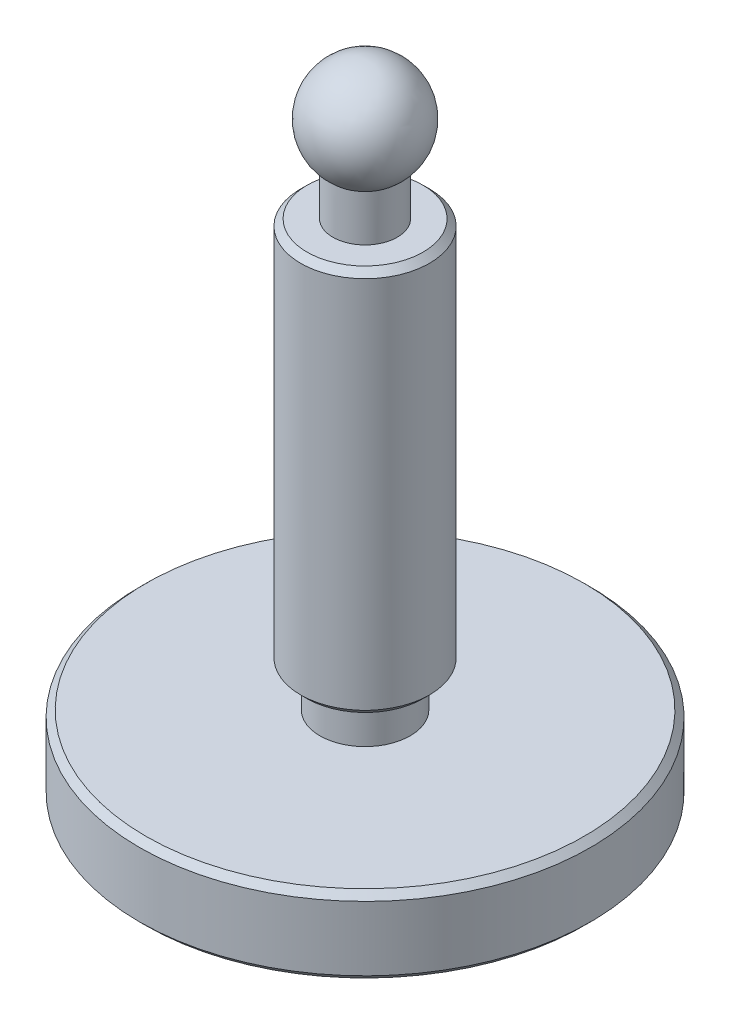
ISO-10303-21;
HEADER;
FILE_DESCRIPTION(('STEP AP214'),'2;1');
FILE_NAME('part.step','',(''),(''),'','','');
FILE_SCHEMA(('AUTOMOTIVE_DESIGN { 1 0 10303 214 1 1 1 1 }'));
ENDSEC;
DATA;
#1=APPLICATION_CONTEXT('core data for automotive mechanical design processes');
#2=APPLICATION_PROTOCOL_DEFINITION('international standard','automotive_design',2000,#1);
#3=PRODUCT_CONTEXT('',#1,'mechanical');
#4=PRODUCT('Part','Part','',(#3));
#5=PRODUCT_RELATED_PRODUCT_CATEGORY('part','',(#4));
#6=PRODUCT_DEFINITION_FORMATION('','',#4);
#7=PRODUCT_DEFINITION_CONTEXT('part definition',#1,'design');
#8=PRODUCT_DEFINITION('design','',#6,#7);
#9=PRODUCT_DEFINITION_SHAPE('','',#8);
#10=(LENGTH_UNIT() NAMED_UNIT(*) SI_UNIT(.MILLI.,.METRE.));
#11=(NAMED_UNIT(*) PLANE_ANGLE_UNIT() SI_UNIT($,.RADIAN.));
#12=(NAMED_UNIT(*) SI_UNIT($,.STERADIAN.) SOLID_ANGLE_UNIT());
#13=UNCERTAINTY_MEASURE_WITH_UNIT(LENGTH_MEASURE(1.E-05),#10,'distance_accuracy_value','');
#14=(GEOMETRIC_REPRESENTATION_CONTEXT(3) GLOBAL_UNCERTAINTY_ASSIGNED_CONTEXT((#13)) GLOBAL_UNIT_ASSIGNED_CONTEXT((#10,
#11,#12)) REPRESENTATION_CONTEXT('',''));
#15=CARTESIAN_POINT('',(0.,0.,0.));
#16=DIRECTION('',(0.,0.,1.));
#17=DIRECTION('',(1.,0.,0.));
#18=AXIS2_PLACEMENT_3D('',#15,#16,#17);
#19=CARTESIAN_POINT('',(0.,6.,0.));
#20=DIRECTION('',(0.,-1.,0.));
#21=DIRECTION('',(0.,0.,-1.));
#22=AXIS2_PLACEMENT_3D('',#19,#20,#21);
#23=CYLINDRICAL_SURFACE('',#22,17.5);
#24=CARTESIAN_POINT('',(0.,0.500000000000004,0.));
#25=DIRECTION('',(0.,1.,0.));
#26=DIRECTION('',(0.,0.,1.));
#27=AXIS2_PLACEMENT_3D('',#24,#25,#26);
#28=CIRCLE('',#27,17.5);
#29=CARTESIAN_POINT('',(0.,0.500000000000004,17.5));
#30=VERTEX_POINT('',#29);
#31=EDGE_CURVE('E76',#30,#30,#28,.T.);
#32=ORIENTED_EDGE('',*,*,#31,.T.);
#33=EDGE_LOOP('',(#32));
#34=FACE_BOUND('',#33,.T.);
#35=CARTESIAN_POINT('',(0.,5.50000000000002,0.));
#36=DIRECTION('',(0.,1.,0.));
#37=DIRECTION('',(0.,0.,1.));
#38=AXIS2_PLACEMENT_3D('',#35,#36,#37);
#39=CIRCLE('',#38,17.5);
#40=CARTESIAN_POINT('',(0.,5.50000000000002,17.5));
#41=VERTEX_POINT('',#40);
#42=EDGE_CURVE('E68',#41,#41,#39,.F.);
#43=ORIENTED_EDGE('',*,*,#42,.T.);
#44=EDGE_LOOP('',(#43));
#45=FACE_BOUND('',#44,.T.);
#46=ADVANCED_FACE('F37',(#34,#45),#23,.T.);
#47=CARTESIAN_POINT('',(0.,6.,0.));
#48=DIRECTION('',(0.,1.,0.));
#49=DIRECTION('',(0.,0.,1.));
#50=AXIS2_PLACEMENT_3D('',#47,#48,#49);
#51=PLANE('',#50);
#52=CARTESIAN_POINT('',(0.,6.,0.));
#53=DIRECTION('',(0.,1.,0.));
#54=DIRECTION('',(0.,0.,1.));
#55=AXIS2_PLACEMENT_3D('',#52,#53,#54);
#56=CIRCLE('',#55,3.5);
#57=CARTESIAN_POINT('',(0.,6.,3.5));
#58=VERTEX_POINT('',#57);
#59=EDGE_CURVE('E62',#58,#58,#56,.F.);
#60=ORIENTED_EDGE('',*,*,#59,.T.);
#61=EDGE_LOOP('',(#60));
#62=FACE_BOUND('',#61,.T.);
#63=CARTESIAN_POINT('',(0.,6.,0.));
#64=DIRECTION('',(0.,1.,0.));
#65=DIRECTION('',(0.,0.,1.));
#66=AXIS2_PLACEMENT_3D('',#63,#64,#65);
#67=CIRCLE('',#66,17.);
#68=CARTESIAN_POINT('',(0.,6.,17.));
#69=VERTEX_POINT('',#68);
#70=EDGE_CURVE('E57',#69,#69,#67,.T.);
#71=ORIENTED_EDGE('',*,*,#70,.T.);
#72=EDGE_LOOP('',(#71));
#73=FACE_BOUND('',#72,.T.);
#74=ADVANCED_FACE('F91',(#62,#73),#51,.T.);
#75=CARTESIAN_POINT('',(0.,0.,0.));
#76=DIRECTION('',(0.,1.,0.));
#77=DIRECTION('',(0.,0.,1.));
#78=AXIS2_PLACEMENT_3D('',#75,#76,#77);
#79=PLANE('',#78);
#80=CARTESIAN_POINT('',(0.,0.,0.));
#81=DIRECTION('',(0.,1.,0.));
#82=DIRECTION('',(0.,0.,1.));
#83=AXIS2_PLACEMENT_3D('',#80,#81,#82);
#84=CIRCLE('',#83,17.);
#85=CARTESIAN_POINT('',(0.,0.,17.));
#86=VERTEX_POINT('',#85);
#87=EDGE_CURVE('E73',#86,#86,#84,.F.);
#88=ORIENTED_EDGE('',*,*,#87,.T.);
#89=EDGE_LOOP('',(#88));
#90=FACE_BOUND('',#89,.T.);
#91=ADVANCED_FACE('F93',(#90),#79,.F.);
#92=CARTESIAN_POINT('',(0.,0.500000000000004,0.));
#93=DIRECTION('',(0.,1.,0.));
#94=DIRECTION('',(0.,0.,1.));
#95=AXIS2_PLACEMENT_3D('',#92,#93,#94);
#96=CONICAL_SURFACE('',#95,17.5,0.785398163397445);
#97=ORIENTED_EDGE('',*,*,#87,.F.);
#98=EDGE_LOOP('',(#97));
#99=FACE_BOUND('',#98,.T.);
#100=ORIENTED_EDGE('',*,*,#31,.F.);
#101=EDGE_LOOP('',(#100));
#102=FACE_BOUND('',#101,.T.);
#103=ADVANCED_FACE('F87',(#99,#102),#96,.T.);
#104=CARTESIAN_POINT('',(0.,6.,0.));
#105=DIRECTION('',(0.,-1.,0.));
#106=DIRECTION('',(0.,0.,-1.));
#107=AXIS2_PLACEMENT_3D('',#104,#105,#106);
#108=CONICAL_SURFACE('',#107,17.,0.785398163397441);
#109=ORIENTED_EDGE('',*,*,#42,.F.);
#110=EDGE_LOOP('',(#109));
#111=FACE_BOUND('',#110,.T.);
#112=ORIENTED_EDGE('',*,*,#70,.F.);
#113=EDGE_LOOP('',(#112));
#114=FACE_BOUND('',#113,.T.);
#115=ADVANCED_FACE('F83',(#111,#114),#108,.T.);
#116=CARTESIAN_POINT('',(0.,45.7080992435478,0.));
#117=DIRECTION('',(0.,-1.,0.));
#118=DIRECTION('',(1.,0.,0.));
#119=AXIS2_PLACEMENT_3D('',#116,#117,#118);
#120=SPHERICAL_SURFACE('',#119,4.);
#121=CARTESIAN_POINT('',(0.,42.5856002443486,0.));
#122=DIRECTION('',(0.,1.,0.));
#123=DIRECTION('',(0.,0.,1.));
#124=AXIS2_PLACEMENT_3D('',#121,#122,#123);
#125=CIRCLE('',#124,2.5);
#126=CARTESIAN_POINT('',(0.,42.5856002443486,2.5));
#127=VERTEX_POINT('',#126);
#128=EDGE_CURVE('E65',#127,#127,#125,.F.);
#129=ORIENTED_EDGE('',*,*,#128,.F.);
#130=EDGE_LOOP('',(#129));
#131=FACE_BOUND('',#130,.T.);
#132=ADVANCED_FACE('F86',(#131),#120,.T.);
#133=CARTESIAN_POINT('',(0.,0.,0.));
#134=DIRECTION('',(0.,-1.,0.));
#135=DIRECTION('',(0.,0.,-1.));
#136=AXIS2_PLACEMENT_3D('',#133,#134,#135);
#137=CYLINDRICAL_SURFACE('',#136,2.5);
#138=CARTESIAN_POINT('',(0.,39.,0.));
#139=DIRECTION('',(0.,-1.,0.));
#140=DIRECTION('',(0.,0.,-1.));
#141=AXIS2_PLACEMENT_3D('',#138,#139,#140);
#142=CIRCLE('',#141,2.5);
#143=CARTESIAN_POINT('',(0.,39.,-2.5));
#144=VERTEX_POINT('',#143);
#145=EDGE_CURVE('E61',#144,#144,#142,.T.);
#146=ORIENTED_EDGE('',*,*,#145,.F.);
#147=EDGE_LOOP('',(#146));
#148=FACE_BOUND('',#147,.T.);
#149=ORIENTED_EDGE('',*,*,#128,.T.);
#150=EDGE_LOOP('',(#149));
#151=FACE_BOUND('',#150,.T.);
#152=ADVANCED_FACE('F110',(#148,#151),#137,.T.);
#153=CARTESIAN_POINT('',(-5.,39.,0.));
#154=DIRECTION('',(0.,-1.,0.));
#155=DIRECTION('',(0.,0.,-1.));
#156=AXIS2_PLACEMENT_3D('',#153,#154,#155);
#157=PLANE('',#156);
#158=CARTESIAN_POINT('',(0.,39.,0.));
#159=DIRECTION('',(0.,-1.,0.));
#160=DIRECTION('',(0.,0.,-1.));
#161=AXIS2_PLACEMENT_3D('',#158,#159,#160);
#162=CIRCLE('',#161,4.5);
#163=CARTESIAN_POINT('',(0.,39.,-4.5));
#164=VERTEX_POINT('',#163);
#165=EDGE_CURVE('E11',#164,#164,#162,.F.);
#166=ORIENTED_EDGE('',*,*,#165,.T.);
#167=EDGE_LOOP('',(#166));
#168=FACE_BOUND('',#167,.T.);
#169=ORIENTED_EDGE('',*,*,#145,.T.);
#170=EDGE_LOOP('',(#169));
#171=FACE_BOUND('',#170,.T.);
#172=ADVANCED_FACE('F113',(#168,#171),#157,.F.);
#173=CARTESIAN_POINT('',(0.,0.,0.));
#174=DIRECTION('',(0.,-1.,0.));
#175=DIRECTION('',(0.,0.,-1.));
#176=AXIS2_PLACEMENT_3D('',#173,#174,#175);
#177=CYLINDRICAL_SURFACE('',#176,5.);
#178=CARTESIAN_POINT('',(0.,9.49999999999999,0.));
#179=DIRECTION('',(0.,1.,0.));
#180=DIRECTION('',(0.,0.,1.));
#181=AXIS2_PLACEMENT_3D('',#178,#179,#180);
#182=CIRCLE('',#181,5.);
#183=CARTESIAN_POINT('',(0.,9.49999999999999,5.));
#184=VERTEX_POINT('',#183);
#185=EDGE_CURVE('E44',#184,#184,#182,.T.);
#186=ORIENTED_EDGE('',*,*,#185,.T.);
#187=EDGE_LOOP('',(#186));
#188=FACE_BOUND('',#187,.T.);
#189=CARTESIAN_POINT('',(0.,38.5,0.));
#190=DIRECTION('',(0.,-1.,0.));
#191=DIRECTION('',(0.,0.,-1.));
#192=AXIS2_PLACEMENT_3D('',#189,#190,#191);
#193=CIRCLE('',#192,5.);
#194=CARTESIAN_POINT('',(0.,38.5,-5.));
#195=VERTEX_POINT('',#194);
#196=EDGE_CURVE('E48',#195,#195,#193,.T.);
#197=ORIENTED_EDGE('',*,*,#196,.T.);
#198=EDGE_LOOP('',(#197));
#199=FACE_BOUND('',#198,.T.);
#200=ADVANCED_FACE('F131',(#188,#199),#177,.T.);
#201=CARTESIAN_POINT('',(-2.5,9.,0.));
#202=DIRECTION('',(0.,1.,0.));
#203=DIRECTION('',(0.,0.,1.));
#204=AXIS2_PLACEMENT_3D('',#201,#202,#203);
#205=PLANE('',#204);
#206=CARTESIAN_POINT('',(0.,9.,0.));
#207=DIRECTION('',(0.,1.,0.));
#208=DIRECTION('',(0.,0.,1.));
#209=AXIS2_PLACEMENT_3D('',#206,#207,#208);
#210=CIRCLE('',#209,4.50000000000002);
#211=CARTESIAN_POINT('',(0.,9.,4.50000000000002));
#212=VERTEX_POINT('',#211);
#213=EDGE_CURVE('E52',#212,#212,#210,.F.);
#214=ORIENTED_EDGE('',*,*,#213,.T.);
#215=EDGE_LOOP('',(#214));
#216=FACE_BOUND('',#215,.T.);
#217=CARTESIAN_POINT('',(0.,9.,0.));
#218=DIRECTION('',(0.,1.,0.));
#219=DIRECTION('',(0.,0.,1.));
#220=AXIS2_PLACEMENT_3D('',#217,#218,#219);
#221=CIRCLE('',#220,3.5);
#222=CARTESIAN_POINT('',(0.,9.,3.5));
#223=VERTEX_POINT('',#222);
#224=EDGE_CURVE('E58',#223,#223,#221,.F.);
#225=ORIENTED_EDGE('',*,*,#224,.F.);
#226=EDGE_LOOP('',(#225));
#227=FACE_BOUND('',#226,.T.);
#228=ADVANCED_FACE('F118',(#216,#227),#205,.F.);
#229=CARTESIAN_POINT('',(0.,0.,0.));
#230=DIRECTION('',(0.,-1.,0.));
#231=DIRECTION('',(0.,0.,-1.));
#232=AXIS2_PLACEMENT_3D('',#229,#230,#231);
#233=CYLINDRICAL_SURFACE('',#232,3.5);
#234=ORIENTED_EDGE('',*,*,#59,.F.);
#235=EDGE_LOOP('',(#234));
#236=FACE_BOUND('',#235,.T.);
#237=ORIENTED_EDGE('',*,*,#224,.T.);
#238=EDGE_LOOP('',(#237));
#239=FACE_BOUND('',#238,.T.);
#240=ADVANCED_FACE('F115',(#236,#239),#233,.T.);
#241=CARTESIAN_POINT('',(0.,9.,0.));
#242=DIRECTION('',(0.,1.,0.));
#243=DIRECTION('',(0.,0.,1.));
#244=AXIS2_PLACEMENT_3D('',#241,#242,#243);
#245=CONICAL_SURFACE('',#244,4.50000000000002,0.785398163397445);
#246=ORIENTED_EDGE('',*,*,#185,.F.);
#247=EDGE_LOOP('',(#246));
#248=FACE_BOUND('',#247,.T.);
#249=ORIENTED_EDGE('',*,*,#213,.F.);
#250=EDGE_LOOP('',(#249));
#251=FACE_BOUND('',#250,.T.);
#252=ADVANCED_FACE('F117',(#248,#251),#245,.T.);
#253=CARTESIAN_POINT('',(0.,38.5,0.));
#254=DIRECTION('',(0.,-1.,0.));
#255=DIRECTION('',(0.,0.,-1.));
#256=AXIS2_PLACEMENT_3D('',#253,#254,#255);
#257=CONICAL_SURFACE('',#256,5.,0.785398163397452);
#258=ORIENTED_EDGE('',*,*,#165,.F.);
#259=EDGE_LOOP('',(#258));
#260=FACE_BOUND('',#259,.T.);
#261=ORIENTED_EDGE('',*,*,#196,.F.);
#262=EDGE_LOOP('',(#261));
#263=FACE_BOUND('',#262,.T.);
#264=ADVANCED_FACE('F39',(#260,#263),#257,.T.);
#265=CLOSED_SHELL('',(#46,#74,#91,#103,#115,#132,#152,#172,#200,#228,#240,#252,#264));
#266=MANIFOLD_SOLID_BREP('B2',#265);
#267=ADVANCED_BREP_SHAPE_REPRESENTATION('',(#18,#266),#14);
#268=SHAPE_DEFINITION_REPRESENTATION(#9,#267);
ENDSEC;
END-ISO-10303-21;
